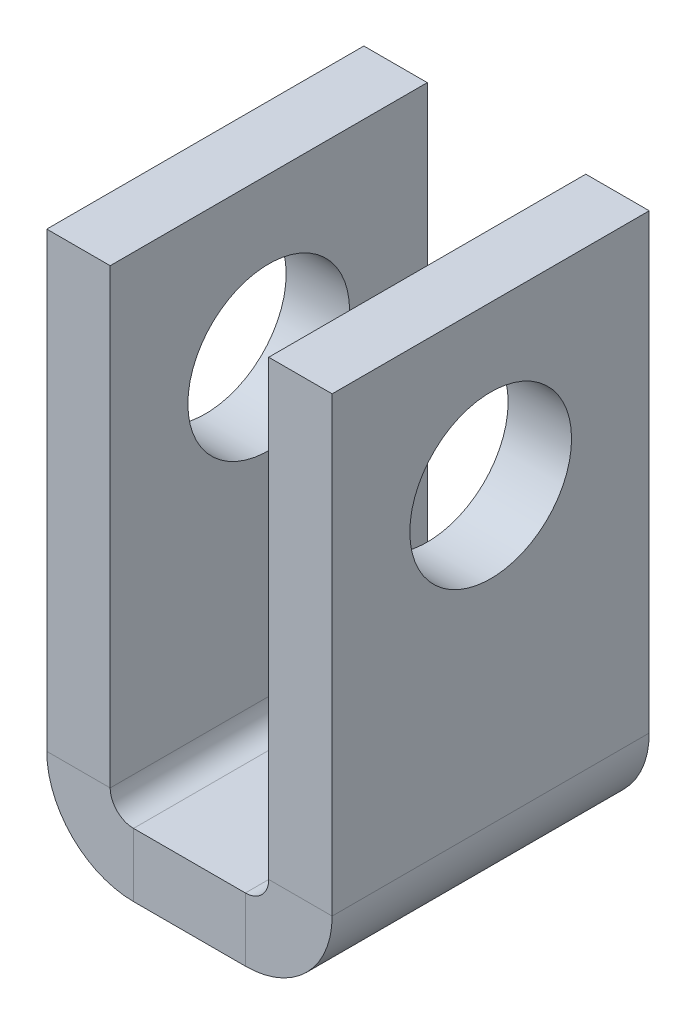
ISO-10303-21;
HEADER;
FILE_DESCRIPTION(('STEP AP214'),'2;1');
FILE_NAME('part.step','',(''),(''),'','','');
FILE_SCHEMA(('AUTOMOTIVE_DESIGN { 1 0 10303 214 1 1 1 1 }'));
ENDSEC;
DATA;
#1=APPLICATION_CONTEXT('core data for automotive mechanical design processes');
#2=APPLICATION_PROTOCOL_DEFINITION('international standard','automotive_design',2000,#1);
#3=PRODUCT_CONTEXT('',#1,'mechanical');
#4=PRODUCT('Part','Part','',(#3));
#5=PRODUCT_RELATED_PRODUCT_CATEGORY('part','',(#4));
#6=PRODUCT_DEFINITION_FORMATION('','',#4);
#7=PRODUCT_DEFINITION_CONTEXT('part definition',#1,'design');
#8=PRODUCT_DEFINITION('design','',#6,#7);
#9=PRODUCT_DEFINITION_SHAPE('','',#8);
#10=(LENGTH_UNIT() NAMED_UNIT(*) SI_UNIT(.MILLI.,.METRE.));
#11=(NAMED_UNIT(*) PLANE_ANGLE_UNIT() SI_UNIT($,.RADIAN.));
#12=(NAMED_UNIT(*) SI_UNIT($,.STERADIAN.) SOLID_ANGLE_UNIT());
#13=UNCERTAINTY_MEASURE_WITH_UNIT(LENGTH_MEASURE(1.E-05),#10,'distance_accuracy_value','');
#14=(GEOMETRIC_REPRESENTATION_CONTEXT(3) GLOBAL_UNCERTAINTY_ASSIGNED_CONTEXT((#13)) GLOBAL_UNIT_ASSIGNED_CONTEXT((#10,
#11,#12)) REPRESENTATION_CONTEXT('',''));
#15=CARTESIAN_POINT('',(0.,0.,0.));
#16=DIRECTION('',(0.,0.,1.));
#17=DIRECTION('',(1.,0.,0.));
#18=AXIS2_PLACEMENT_3D('',#15,#16,#17);
#19=CARTESIAN_POINT('',(0.7366,0.,10.));
#20=DIRECTION('',(0.,0.,1.));
#21=DIRECTION('',(1.,0.,0.));
#22=AXIS2_PLACEMENT_3D('',#19,#20,#21);
#23=PLANE('',#22);
#24=DIRECTION('',(0.,-1.,0.));
#25=VECTOR('',#24,1.);
#26=CARTESIAN_POINT('',(0.7366,0.,10.));
#27=LINE('',#26,#25);
#28=CARTESIAN_POINT('',(0.7366,0.,10.));
#29=VERTEX_POINT('',#28);
#30=CARTESIAN_POINT('',(0.7366,-2.,10.));
#31=VERTEX_POINT('',#30);
#32=EDGE_CURVE('E11',#29,#31,#27,.T.);
#33=ORIENTED_EDGE('',*,*,#32,.F.);
#34=CARTESIAN_POINT('',(0.7366,0.7366,10.));
#35=DIRECTION('',(0.,0.,-1.));
#36=DIRECTION('',(-1.,0.,0.));
#37=AXIS2_PLACEMENT_3D('',#34,#35,#36);
#38=CIRCLE('',#37,0.7366);
#39=CARTESIAN_POINT('',(0.,0.7366,10.));
#40=VERTEX_POINT('',#39);
#41=EDGE_CURVE('E250',#40,#29,#38,.F.);
#42=ORIENTED_EDGE('',*,*,#41,.F.);
#43=DIRECTION('',(1.,0.,0.));
#44=VECTOR('',#43,1.);
#45=CARTESIAN_POINT('',(-2.,0.736600000000001,10.));
#46=LINE('',#45,#44);
#47=CARTESIAN_POINT('',(-2.,0.736600000000001,10.));
#48=VERTEX_POINT('',#47);
#49=EDGE_CURVE('E47',#48,#40,#46,.T.);
#50=ORIENTED_EDGE('',*,*,#49,.F.);
#51=CARTESIAN_POINT('',(0.7366,0.7366,10.));
#52=DIRECTION('',(0.,0.,1.));
#53=DIRECTION('',(1.,0.,0.));
#54=AXIS2_PLACEMENT_3D('',#51,#52,#53);
#55=CIRCLE('',#54,2.7366);
#56=EDGE_CURVE('E148',#48,#31,#55,.T.);
#57=ORIENTED_EDGE('',*,*,#56,.T.);
#58=EDGE_LOOP('',(#33,#42,#50,#57));
#59=FACE_BOUND('',#58,.T.);
#60=ADVANCED_FACE('F39',(#59),#23,.T.);
#61=CARTESIAN_POINT('',(-2.,0.736600000000001,10.));
#62=DIRECTION('',(0.,0.,1.));
#63=DIRECTION('',(1.,0.,0.));
#64=AXIS2_PLACEMENT_3D('',#61,#62,#63);
#65=PLANE('',#64);
#66=DIRECTION('',(1.,0.,0.));
#67=VECTOR('',#66,1.);
#68=CARTESIAN_POINT('',(0.,0.,10.));
#69=LINE('',#68,#67);
#70=CARTESIAN_POINT('',(4.2634,0.,10.));
#71=VERTEX_POINT('',#70);
#72=EDGE_CURVE('E142',#29,#71,#69,.T.);
#73=ORIENTED_EDGE('',*,*,#72,.F.);
#74=ORIENTED_EDGE('',*,*,#32,.T.);
#75=DIRECTION('',(1.,0.,0.));
#76=VECTOR('',#75,1.);
#77=CARTESIAN_POINT('',(0.,-2.,10.));
#78=LINE('',#77,#76);
#79=CARTESIAN_POINT('',(4.2634,-2.,10.));
#80=VERTEX_POINT('',#79);
#81=EDGE_CURVE('E139',#31,#80,#78,.T.);
#82=ORIENTED_EDGE('',*,*,#81,.T.);
#83=DIRECTION('',(0.,1.,0.));
#84=VECTOR('',#83,1.);
#85=CARTESIAN_POINT('',(4.2634,-2.,10.));
#86=LINE('',#85,#84);
#87=EDGE_CURVE('E231',#80,#71,#86,.T.);
#88=ORIENTED_EDGE('',*,*,#87,.T.);
#89=EDGE_LOOP('',(#73,#74,#82,#88));
#90=FACE_BOUND('',#89,.T.);
#91=ADVANCED_FACE('F137',(#90),#65,.T.);
#92=CARTESIAN_POINT('',(0.,0.7366,0.));
#93=DIRECTION('',(0.,0.,-1.));
#94=DIRECTION('',(-1.,0.,0.));
#95=AXIS2_PLACEMENT_3D('',#92,#93,#94);
#96=PLANE('',#95);
#97=DIRECTION('',(-1.,0.,0.));
#98=VECTOR('',#97,1.);
#99=CARTESIAN_POINT('',(0.,0.7366,0.));
#100=LINE('',#99,#98);
#101=CARTESIAN_POINT('',(0.,0.7366,0.));
#102=VERTEX_POINT('',#101);
#103=CARTESIAN_POINT('',(-2.,0.736600000000001,0.));
#104=VERTEX_POINT('',#103);
#105=EDGE_CURVE('E236',#102,#104,#100,.T.);
#106=ORIENTED_EDGE('',*,*,#105,.F.);
#107=CARTESIAN_POINT('',(0.7366,0.7366,0.));
#108=DIRECTION('',(0.,0.,-1.));
#109=DIRECTION('',(-1.,0.,0.));
#110=AXIS2_PLACEMENT_3D('',#107,#108,#109);
#111=CIRCLE('',#110,0.7366);
#112=CARTESIAN_POINT('',(0.7366,0.,0.));
#113=VERTEX_POINT('',#112);
#114=EDGE_CURVE('E188',#102,#113,#111,.F.);
#115=ORIENTED_EDGE('',*,*,#114,.T.);
#116=DIRECTION('',(0.,1.,0.));
#117=VECTOR('',#116,1.);
#118=CARTESIAN_POINT('',(0.7366,-2.,0.));
#119=LINE('',#118,#117);
#120=CARTESIAN_POINT('',(0.7366,-2.,0.));
#121=VERTEX_POINT('',#120);
#122=EDGE_CURVE('E234',#121,#113,#119,.T.);
#123=ORIENTED_EDGE('',*,*,#122,.F.);
#124=CARTESIAN_POINT('',(0.7366,0.7366,0.));
#125=DIRECTION('',(0.,0.,1.));
#126=DIRECTION('',(1.,0.,0.));
#127=AXIS2_PLACEMENT_3D('',#124,#125,#126);
#128=CIRCLE('',#127,2.7366);
#129=EDGE_CURVE('E160',#104,#121,#128,.T.);
#130=ORIENTED_EDGE('',*,*,#129,.F.);
#131=EDGE_LOOP('',(#106,#115,#123,#130));
#132=FACE_BOUND('',#131,.T.);
#133=ADVANCED_FACE('F300',(#132),#96,.T.);
#134=CARTESIAN_POINT('',(0.7366,-2.,0.));
#135=DIRECTION('',(0.,0.,-1.));
#136=DIRECTION('',(-1.,0.,0.));
#137=AXIS2_PLACEMENT_3D('',#134,#135,#136);
#138=PLANE('',#137);
#139=DIRECTION('',(0.,-1.,0.));
#140=VECTOR('',#139,1.);
#141=CARTESIAN_POINT('',(0.,15.,0.));
#142=LINE('',#141,#140);
#143=CARTESIAN_POINT('',(0.,15.,0.));
#144=VERTEX_POINT('',#143);
#145=EDGE_CURVE('E191',#144,#102,#142,.T.);
#146=ORIENTED_EDGE('',*,*,#145,.T.);
#147=ORIENTED_EDGE('',*,*,#105,.T.);
#148=DIRECTION('',(0.,1.,0.));
#149=VECTOR('',#148,1.);
#150=CARTESIAN_POINT('',(-2.,15.,0.));
#151=LINE('',#150,#149);
#152=CARTESIAN_POINT('',(-2.,15.,0.));
#153=VERTEX_POINT('',#152);
#154=EDGE_CURVE('E197',#153,#104,#151,.F.);
#155=ORIENTED_EDGE('',*,*,#154,.F.);
#156=DIRECTION('',(1.,0.,0.));
#157=VECTOR('',#156,1.);
#158=CARTESIAN_POINT('',(-2.,15.,0.));
#159=LINE('',#158,#157);
#160=EDGE_CURVE('E194',#153,#144,#159,.T.);
#161=ORIENTED_EDGE('',*,*,#160,.T.);
#162=EDGE_LOOP('',(#146,#147,#155,#161));
#163=FACE_BOUND('',#162,.T.);
#164=ADVANCED_FACE('F304',(#163),#138,.T.);
#165=CARTESIAN_POINT('',(5.,0.7366,10.));
#166=DIRECTION('',(0.,0.,1.));
#167=DIRECTION('',(1.,0.,0.));
#168=AXIS2_PLACEMENT_3D('',#165,#166,#167);
#169=PLANE('',#168);
#170=DIRECTION('',(1.,0.,0.));
#171=VECTOR('',#170,1.);
#172=CARTESIAN_POINT('',(5.,0.7366,10.));
#173=LINE('',#172,#171);
#174=CARTESIAN_POINT('',(5.,0.7366,10.));
#175=VERTEX_POINT('',#174);
#176=CARTESIAN_POINT('',(7.,0.7366,10.));
#177=VERTEX_POINT('',#176);
#178=EDGE_CURVE('E55',#175,#177,#173,.T.);
#179=ORIENTED_EDGE('',*,*,#178,.F.);
#180=CARTESIAN_POINT('',(4.2634,0.7366,10.));
#181=DIRECTION('',(0.,0.,-1.));
#182=DIRECTION('',(-1.,0.,0.));
#183=AXIS2_PLACEMENT_3D('',#180,#181,#182);
#184=CIRCLE('',#183,0.7366);
#185=EDGE_CURVE('E260',#71,#175,#184,.F.);
#186=ORIENTED_EDGE('',*,*,#185,.F.);
#187=ORIENTED_EDGE('',*,*,#87,.F.);
#188=CARTESIAN_POINT('',(4.2634,0.7366,10.));
#189=DIRECTION('',(0.,0.,1.));
#190=DIRECTION('',(1.,0.,0.));
#191=AXIS2_PLACEMENT_3D('',#188,#189,#190);
#192=CIRCLE('',#191,2.7366);
#193=EDGE_CURVE('E168',#80,#177,#192,.T.);
#194=ORIENTED_EDGE('',*,*,#193,.T.);
#195=EDGE_LOOP('',(#179,#186,#187,#194));
#196=FACE_BOUND('',#195,.T.);
#197=ADVANCED_FACE('F310',(#196),#169,.T.);
#198=CARTESIAN_POINT('',(4.2634,-2.,10.));
#199=DIRECTION('',(0.,0.,1.));
#200=DIRECTION('',(1.,0.,0.));
#201=AXIS2_PLACEMENT_3D('',#198,#199,#200);
#202=PLANE('',#201);
#203=DIRECTION('',(0.,1.,0.));
#204=VECTOR('',#203,1.);
#205=CARTESIAN_POINT('',(5.,0.,10.));
#206=LINE('',#205,#204);
#207=CARTESIAN_POINT('',(5.,15.,10.));
#208=VERTEX_POINT('',#207);
#209=EDGE_CURVE('E263',#175,#208,#206,.T.);
#210=ORIENTED_EDGE('',*,*,#209,.F.);
#211=ORIENTED_EDGE('',*,*,#178,.T.);
#212=DIRECTION('',(0.,1.,0.));
#213=VECTOR('',#212,1.);
#214=CARTESIAN_POINT('',(7.,0.,10.));
#215=LINE('',#214,#213);
#216=CARTESIAN_POINT('',(7.,15.,10.));
#217=VERTEX_POINT('',#216);
#218=EDGE_CURVE('E109',#177,#217,#215,.T.);
#219=ORIENTED_EDGE('',*,*,#218,.T.);
#220=DIRECTION('',(1.,0.,0.));
#221=VECTOR('',#220,1.);
#222=CARTESIAN_POINT('',(5.,15.,10.));
#223=LINE('',#222,#221);
#224=EDGE_CURVE('E266',#208,#217,#223,.T.);
#225=ORIENTED_EDGE('',*,*,#224,.F.);
#226=EDGE_LOOP('',(#210,#211,#219,#225));
#227=FACE_BOUND('',#226,.T.);
#228=ADVANCED_FACE('F314',(#227),#202,.T.);
#229=CARTESIAN_POINT('',(4.2634,0.,0.));
#230=DIRECTION('',(0.,0.,-1.));
#231=DIRECTION('',(-1.,0.,0.));
#232=AXIS2_PLACEMENT_3D('',#229,#230,#231);
#233=PLANE('',#232);
#234=DIRECTION('',(0.,-1.,0.));
#235=VECTOR('',#234,1.);
#236=CARTESIAN_POINT('',(4.2634,0.,0.));
#237=LINE('',#236,#235);
#238=CARTESIAN_POINT('',(4.2634,0.,0.));
#239=VERTEX_POINT('',#238);
#240=CARTESIAN_POINT('',(4.2634,-2.,0.));
#241=VERTEX_POINT('',#240);
#242=EDGE_CURVE('E96',#239,#241,#237,.T.);
#243=ORIENTED_EDGE('',*,*,#242,.F.);
#244=CARTESIAN_POINT('',(4.2634,0.7366,0.));
#245=DIRECTION('',(0.,0.,-1.));
#246=DIRECTION('',(-1.,0.,0.));
#247=AXIS2_PLACEMENT_3D('',#244,#245,#246);
#248=CIRCLE('',#247,0.7366);
#249=CARTESIAN_POINT('',(5.,0.7366,0.));
#250=VERTEX_POINT('',#249);
#251=EDGE_CURVE('E184',#239,#250,#248,.F.);
#252=ORIENTED_EDGE('',*,*,#251,.T.);
#253=DIRECTION('',(-1.,0.,0.));
#254=VECTOR('',#253,1.);
#255=CARTESIAN_POINT('',(7.,0.7366,0.));
#256=LINE('',#255,#254);
#257=CARTESIAN_POINT('',(7.,0.7366,0.));
#258=VERTEX_POINT('',#257);
#259=EDGE_CURVE('E103',#258,#250,#256,.T.);
#260=ORIENTED_EDGE('',*,*,#259,.F.);
#261=CARTESIAN_POINT('',(4.2634,0.7366,0.));
#262=DIRECTION('',(0.,0.,1.));
#263=DIRECTION('',(1.,0.,0.));
#264=AXIS2_PLACEMENT_3D('',#261,#262,#263);
#265=CIRCLE('',#264,2.7366);
#266=EDGE_CURVE('E203',#241,#258,#265,.T.);
#267=ORIENTED_EDGE('',*,*,#266,.F.);
#268=EDGE_LOOP('',(#243,#252,#260,#267));
#269=FACE_BOUND('',#268,.T.);
#270=ADVANCED_FACE('F318',(#269),#233,.T.);
#271=CARTESIAN_POINT('',(7.,0.7366,0.));
#272=DIRECTION('',(0.,0.,-1.));
#273=DIRECTION('',(-1.,0.,0.));
#274=AXIS2_PLACEMENT_3D('',#271,#272,#273);
#275=PLANE('',#274);
#276=DIRECTION('',(1.,0.,0.));
#277=VECTOR('',#276,1.);
#278=CARTESIAN_POINT('',(0.,0.,0.));
#279=LINE('',#278,#277);
#280=EDGE_CURVE('E186',#113,#239,#279,.T.);
#281=ORIENTED_EDGE('',*,*,#280,.T.);
#282=ORIENTED_EDGE('',*,*,#242,.T.);
#283=DIRECTION('',(1.,0.,0.));
#284=VECTOR('',#283,1.);
#285=CARTESIAN_POINT('',(0.,-2.,0.));
#286=LINE('',#285,#284);
#287=EDGE_CURVE('E201',#121,#241,#286,.T.);
#288=ORIENTED_EDGE('',*,*,#287,.F.);
#289=ORIENTED_EDGE('',*,*,#122,.T.);
#290=EDGE_LOOP('',(#281,#282,#288,#289));
#291=FACE_BOUND('',#290,.T.);
#292=ADVANCED_FACE('F321',(#291),#275,.T.);
#293=CARTESIAN_POINT('',(7.,0.,10.));
#294=DIRECTION('',(-1.,0.,0.));
#295=DIRECTION('',(0.,0.,1.));
#296=AXIS2_PLACEMENT_3D('',#293,#294,#295);
#297=PLANE('',#296);
#298=CARTESIAN_POINT('',(7.,10.,5.));
#299=DIRECTION('',(-1.,0.,0.));
#300=DIRECTION('',(0.,0.,1.));
#301=AXIS2_PLACEMENT_3D('',#298,#299,#300);
#302=CIRCLE('',#301,2.55);
#303=CARTESIAN_POINT('',(7.,10.,7.55));
#304=VERTEX_POINT('',#303);
#305=EDGE_CURVE('E275',#304,#304,#302,.T.);
#306=ORIENTED_EDGE('',*,*,#305,.T.);
#307=EDGE_LOOP('',(#306));
#308=FACE_BOUND('',#307,.T.);
#309=DIRECTION('',(0.,1.,0.));
#310=VECTOR('',#309,1.);
#311=CARTESIAN_POINT('',(7.,0.,0.));
#312=LINE('',#311,#310);
#313=CARTESIAN_POINT('',(7.,15.,0.));
#314=VERTEX_POINT('',#313);
#315=EDGE_CURVE('E174',#258,#314,#312,.T.);
#316=ORIENTED_EDGE('',*,*,#315,.T.);
#317=DIRECTION('',(0.,0.,-1.));
#318=VECTOR('',#317,1.);
#319=CARTESIAN_POINT('',(7.,15.,10.));
#320=LINE('',#319,#318);
#321=EDGE_CURVE('E227',#217,#314,#320,.T.);
#322=ORIENTED_EDGE('',*,*,#321,.F.);
#323=ORIENTED_EDGE('',*,*,#218,.F.);
#324=DIRECTION('',(0.,0.,-1.));
#325=VECTOR('',#324,1.);
#326=CARTESIAN_POINT('',(7.,0.7366,10.));
#327=LINE('',#326,#325);
#328=EDGE_CURVE('E170',#177,#258,#327,.T.);
#329=ORIENTED_EDGE('',*,*,#328,.T.);
#330=EDGE_LOOP('',(#316,#322,#323,#329));
#331=FACE_BOUND('',#330,.T.);
#332=ADVANCED_FACE('F282',(#308,#331),#297,.F.);
#333=CARTESIAN_POINT('',(5.,15.,10.));
#334=DIRECTION('',(0.,1.,0.));
#335=DIRECTION('',(0.,0.,1.));
#336=AXIS2_PLACEMENT_3D('',#333,#334,#335);
#337=PLANE('',#336);
#338=DIRECTION('',(1.,0.,0.));
#339=VECTOR('',#338,1.);
#340=CARTESIAN_POINT('',(5.,15.,0.));
#341=LINE('',#340,#339);
#342=CARTESIAN_POINT('',(5.,15.,0.));
#343=VERTEX_POINT('',#342);
#344=EDGE_CURVE('E177',#343,#314,#341,.T.);
#345=ORIENTED_EDGE('',*,*,#344,.F.);
#346=DIRECTION('',(0.,0.,-1.));
#347=VECTOR('',#346,1.);
#348=CARTESIAN_POINT('',(5.,15.,10.));
#349=LINE('',#348,#347);
#350=EDGE_CURVE('E225',#208,#343,#349,.T.);
#351=ORIENTED_EDGE('',*,*,#350,.F.);
#352=ORIENTED_EDGE('',*,*,#224,.T.);
#353=ORIENTED_EDGE('',*,*,#321,.T.);
#354=EDGE_LOOP('',(#345,#351,#352,#353));
#355=FACE_BOUND('',#354,.T.);
#356=ADVANCED_FACE('F326',(#355),#337,.T.);
#357=CARTESIAN_POINT('',(5.,0.,10.));
#358=DIRECTION('',(-1.,0.,0.));
#359=DIRECTION('',(0.,0.,1.));
#360=AXIS2_PLACEMENT_3D('',#357,#358,#359);
#361=PLANE('',#360);
#362=CARTESIAN_POINT('',(5.,10.,5.));
#363=DIRECTION('',(-1.,0.,0.));
#364=DIRECTION('',(0.,0.,1.));
#365=AXIS2_PLACEMENT_3D('',#362,#363,#364);
#366=CIRCLE('',#365,2.55);
#367=CARTESIAN_POINT('',(5.,10.,7.55));
#368=VERTEX_POINT('',#367);
#369=EDGE_CURVE('E178',#368,#368,#366,.T.);
#370=ORIENTED_EDGE('',*,*,#369,.F.);
#371=EDGE_LOOP('',(#370));
#372=FACE_BOUND('',#371,.T.);
#373=DIRECTION('',(0.,1.,0.));
#374=VECTOR('',#373,1.);
#375=CARTESIAN_POINT('',(5.,0.,0.));
#376=LINE('',#375,#374);
#377=EDGE_CURVE('E181',#250,#343,#376,.T.);
#378=ORIENTED_EDGE('',*,*,#377,.F.);
#379=DIRECTION('',(0.,0.,-1.));
#380=VECTOR('',#379,1.);
#381=CARTESIAN_POINT('',(5.,0.7366,10.));
#382=LINE('',#381,#380);
#383=EDGE_CURVE('E222',#175,#250,#382,.T.);
#384=ORIENTED_EDGE('',*,*,#383,.F.);
#385=ORIENTED_EDGE('',*,*,#209,.T.);
#386=ORIENTED_EDGE('',*,*,#350,.T.);
#387=EDGE_LOOP('',(#378,#384,#385,#386));
#388=FACE_BOUND('',#387,.T.);
#389=ADVANCED_FACE('F329',(#372,#388),#361,.T.);
#390=CARTESIAN_POINT('',(4.2634,0.7366,10.));
#391=DIRECTION('',(0.,0.,-1.));
#392=DIRECTION('',(-1.,0.,0.));
#393=AXIS2_PLACEMENT_3D('',#390,#391,#392);
#394=CYLINDRICAL_SURFACE('',#393,0.7366);
#395=ORIENTED_EDGE('',*,*,#251,.F.);
#396=DIRECTION('',(0.,0.,-1.));
#397=VECTOR('',#396,1.);
#398=CARTESIAN_POINT('',(4.2634,0.,10.));
#399=LINE('',#398,#397);
#400=EDGE_CURVE('E219',#71,#239,#399,.T.);
#401=ORIENTED_EDGE('',*,*,#400,.F.);
#402=ORIENTED_EDGE('',*,*,#185,.T.);
#403=ORIENTED_EDGE('',*,*,#383,.T.);
#404=EDGE_LOOP('',(#395,#401,#402,#403));
#405=FACE_BOUND('',#404,.T.);
#406=ADVANCED_FACE('F333',(#405),#394,.F.);
#407=CARTESIAN_POINT('',(0.,0.,10.));
#408=DIRECTION('',(0.,1.,0.));
#409=DIRECTION('',(0.,0.,1.));
#410=AXIS2_PLACEMENT_3D('',#407,#408,#409);
#411=PLANE('',#410);
#412=ORIENTED_EDGE('',*,*,#280,.F.);
#413=DIRECTION('',(0.,0.,-1.));
#414=VECTOR('',#413,1.);
#415=CARTESIAN_POINT('',(0.7366,0.,10.));
#416=LINE('',#415,#414);
#417=EDGE_CURVE('E216',#29,#113,#416,.T.);
#418=ORIENTED_EDGE('',*,*,#417,.F.);
#419=ORIENTED_EDGE('',*,*,#72,.T.);
#420=ORIENTED_EDGE('',*,*,#400,.T.);
#421=EDGE_LOOP('',(#412,#418,#419,#420));
#422=FACE_BOUND('',#421,.T.);
#423=ADVANCED_FACE('F337',(#422),#411,.T.);
#424=CARTESIAN_POINT('',(0.7366,0.7366,10.));
#425=DIRECTION('',(0.,0.,-1.));
#426=DIRECTION('',(-1.,0.,0.));
#427=AXIS2_PLACEMENT_3D('',#424,#425,#426);
#428=CYLINDRICAL_SURFACE('',#427,0.7366);
#429=ORIENTED_EDGE('',*,*,#114,.F.);
#430=DIRECTION('',(0.,0.,-1.));
#431=VECTOR('',#430,1.);
#432=CARTESIAN_POINT('',(0.,0.7366,10.));
#433=LINE('',#432,#431);
#434=EDGE_CURVE('E213',#40,#102,#433,.T.);
#435=ORIENTED_EDGE('',*,*,#434,.F.);
#436=ORIENTED_EDGE('',*,*,#41,.T.);
#437=ORIENTED_EDGE('',*,*,#417,.T.);
#438=EDGE_LOOP('',(#429,#435,#436,#437));
#439=FACE_BOUND('',#438,.T.);
#440=ADVANCED_FACE('F249',(#439),#428,.F.);
#441=CARTESIAN_POINT('',(0.,15.,10.));
#442=DIRECTION('',(1.,0.,0.));
#443=DIRECTION('',(0.,0.,-1.));
#444=AXIS2_PLACEMENT_3D('',#441,#442,#443);
#445=PLANE('',#444);
#446=CARTESIAN_POINT('',(0.,10.,5.));
#447=DIRECTION('',(1.,0.,0.));
#448=DIRECTION('',(0.,0.,-1.));
#449=AXIS2_PLACEMENT_3D('',#446,#447,#448);
#450=CIRCLE('',#449,2.55);
#451=CARTESIAN_POINT('',(0.,10.,2.45));
#452=VERTEX_POINT('',#451);
#453=EDGE_CURVE('E272',#452,#452,#450,.T.);
#454=ORIENTED_EDGE('',*,*,#453,.F.);
#455=EDGE_LOOP('',(#454));
#456=FACE_BOUND('',#455,.T.);
#457=ORIENTED_EDGE('',*,*,#145,.F.);
#458=DIRECTION('',(0.,0.,-1.));
#459=VECTOR('',#458,1.);
#460=CARTESIAN_POINT('',(0.,15.,10.));
#461=LINE('',#460,#459);
#462=CARTESIAN_POINT('',(0.,15.,10.));
#463=VERTEX_POINT('',#462);
#464=EDGE_CURVE('E211',#463,#144,#461,.T.);
#465=ORIENTED_EDGE('',*,*,#464,.F.);
#466=DIRECTION('',(0.,-1.,0.));
#467=VECTOR('',#466,1.);
#468=CARTESIAN_POINT('',(0.,15.,10.));
#469=LINE('',#468,#467);
#470=EDGE_CURVE('E243',#463,#40,#469,.T.);
#471=ORIENTED_EDGE('',*,*,#470,.T.);
#472=ORIENTED_EDGE('',*,*,#434,.T.);
#473=EDGE_LOOP('',(#457,#465,#471,#472));
#474=FACE_BOUND('',#473,.T.);
#475=ADVANCED_FACE('F254',(#456,#474),#445,.T.);
#476=CARTESIAN_POINT('',(-2.,15.,10.));
#477=DIRECTION('',(0.,1.,0.));
#478=DIRECTION('',(0.,0.,1.));
#479=AXIS2_PLACEMENT_3D('',#476,#477,#478);
#480=PLANE('',#479);
#481=ORIENTED_EDGE('',*,*,#160,.F.);
#482=DIRECTION('',(0.,0.,-1.));
#483=VECTOR('',#482,1.);
#484=CARTESIAN_POINT('',(-2.,15.,10.));
#485=LINE('',#484,#483);
#486=CARTESIAN_POINT('',(-2.,15.,10.));
#487=VERTEX_POINT('',#486);
#488=EDGE_CURVE('E209',#487,#153,#485,.T.);
#489=ORIENTED_EDGE('',*,*,#488,.F.);
#490=DIRECTION('',(1.,0.,0.));
#491=VECTOR('',#490,1.);
#492=CARTESIAN_POINT('',(-2.,15.,10.));
#493=LINE('',#492,#491);
#494=EDGE_CURVE('E255',#487,#463,#493,.T.);
#495=ORIENTED_EDGE('',*,*,#494,.T.);
#496=ORIENTED_EDGE('',*,*,#464,.T.);
#497=EDGE_LOOP('',(#481,#489,#495,#496));
#498=FACE_BOUND('',#497,.T.);
#499=ADVANCED_FACE('F346',(#498),#480,.T.);
#500=CARTESIAN_POINT('',(-2.,15.,10.));
#501=DIRECTION('',(1.,0.,0.));
#502=DIRECTION('',(0.,0.,-1.));
#503=AXIS2_PLACEMENT_3D('',#500,#501,#502);
#504=PLANE('',#503);
#505=CARTESIAN_POINT('',(-2.,10.,5.));
#506=DIRECTION('',(-1.,0.,0.));
#507=DIRECTION('',(0.,0.,1.));
#508=AXIS2_PLACEMENT_3D('',#505,#506,#507);
#509=CIRCLE('',#508,2.55);
#510=CARTESIAN_POINT('',(-2.,10.,7.55));
#511=VERTEX_POINT('',#510);
#512=EDGE_CURVE('E276',#511,#511,#509,.T.);
#513=ORIENTED_EDGE('',*,*,#512,.F.);
#514=EDGE_LOOP('',(#513));
#515=FACE_BOUND('',#514,.T.);
#516=ORIENTED_EDGE('',*,*,#154,.T.);
#517=DIRECTION('',(0.,0.,-1.));
#518=VECTOR('',#517,1.);
#519=CARTESIAN_POINT('',(-2.,0.736600000000001,10.));
#520=LINE('',#519,#518);
#521=EDGE_CURVE('E162',#48,#104,#520,.T.);
#522=ORIENTED_EDGE('',*,*,#521,.F.);
#523=DIRECTION('',(0.,1.,0.));
#524=VECTOR('',#523,1.);
#525=CARTESIAN_POINT('',(-2.,15.,10.));
#526=LINE('',#525,#524);
#527=EDGE_CURVE('E153',#487,#48,#526,.F.);
#528=ORIENTED_EDGE('',*,*,#527,.F.);
#529=ORIENTED_EDGE('',*,*,#488,.T.);
#530=EDGE_LOOP('',(#516,#522,#528,#529));
#531=FACE_BOUND('',#530,.T.);
#532=ADVANCED_FACE('F350',(#515,#531),#504,.F.);
#533=CARTESIAN_POINT('',(0.7366,0.7366,10.));
#534=DIRECTION('',(0.,0.,-1.));
#535=DIRECTION('',(-1.,0.,0.));
#536=AXIS2_PLACEMENT_3D('',#533,#534,#535);
#537=CYLINDRICAL_SURFACE('',#536,2.7366);
#538=ORIENTED_EDGE('',*,*,#129,.T.);
#539=DIRECTION('',(0.,0.,-1.));
#540=VECTOR('',#539,1.);
#541=CARTESIAN_POINT('',(0.7366,-2.,10.));
#542=LINE('',#541,#540);
#543=EDGE_CURVE('E157',#31,#121,#542,.T.);
#544=ORIENTED_EDGE('',*,*,#543,.F.);
#545=ORIENTED_EDGE('',*,*,#56,.F.);
#546=ORIENTED_EDGE('',*,*,#521,.T.);
#547=EDGE_LOOP('',(#538,#544,#545,#546));
#548=FACE_BOUND('',#547,.T.);
#549=ADVANCED_FACE('F158',(#548),#537,.T.);
#550=CARTESIAN_POINT('',(0.,-2.,10.));
#551=DIRECTION('',(0.,1.,0.));
#552=DIRECTION('',(0.,0.,1.));
#553=AXIS2_PLACEMENT_3D('',#550,#551,#552);
#554=PLANE('',#553);
#555=ORIENTED_EDGE('',*,*,#287,.T.);
#556=DIRECTION('',(0.,0.,-1.));
#557=VECTOR('',#556,1.);
#558=CARTESIAN_POINT('',(4.2634,-2.,10.));
#559=LINE('',#558,#557);
#560=EDGE_CURVE('E163',#80,#241,#559,.T.);
#561=ORIENTED_EDGE('',*,*,#560,.F.);
#562=ORIENTED_EDGE('',*,*,#81,.F.);
#563=ORIENTED_EDGE('',*,*,#543,.T.);
#564=EDGE_LOOP('',(#555,#561,#562,#563));
#565=FACE_BOUND('',#564,.T.);
#566=ADVANCED_FACE('F165',(#565),#554,.F.);
#567=CARTESIAN_POINT('',(4.2634,0.7366,10.));
#568=DIRECTION('',(0.,0.,-1.));
#569=DIRECTION('',(-1.,0.,0.));
#570=AXIS2_PLACEMENT_3D('',#567,#568,#569);
#571=CYLINDRICAL_SURFACE('',#570,2.7366);
#572=ORIENTED_EDGE('',*,*,#266,.T.);
#573=ORIENTED_EDGE('',*,*,#328,.F.);
#574=ORIENTED_EDGE('',*,*,#193,.F.);
#575=ORIENTED_EDGE('',*,*,#560,.T.);
#576=EDGE_LOOP('',(#572,#573,#574,#575));
#577=FACE_BOUND('',#576,.T.);
#578=ADVANCED_FACE('F359',(#577),#571,.T.);
#579=CARTESIAN_POINT('',(4.2634,0.7366,10.));
#580=DIRECTION('',(0.,0.,-1.));
#581=DIRECTION('',(-1.,0.,0.));
#582=AXIS2_PLACEMENT_3D('',#579,#580,#581);
#583=PLANE('',#582);
#584=ORIENTED_EDGE('',*,*,#527,.T.);
#585=ORIENTED_EDGE('',*,*,#49,.T.);
#586=ORIENTED_EDGE('',*,*,#470,.F.);
#587=ORIENTED_EDGE('',*,*,#494,.F.);
#588=EDGE_LOOP('',(#584,#585,#586,#587));
#589=FACE_BOUND('',#588,.T.);
#590=ADVANCED_FACE('F240',(#589),#583,.F.);
#591=CARTESIAN_POINT('',(4.2634,0.7366,0.));
#592=DIRECTION('',(0.,0.,-1.));
#593=DIRECTION('',(-1.,0.,0.));
#594=AXIS2_PLACEMENT_3D('',#591,#592,#593);
#595=PLANE('',#594);
#596=ORIENTED_EDGE('',*,*,#315,.F.);
#597=ORIENTED_EDGE('',*,*,#259,.T.);
#598=ORIENTED_EDGE('',*,*,#377,.T.);
#599=ORIENTED_EDGE('',*,*,#344,.T.);
#600=EDGE_LOOP('',(#596,#597,#598,#599));
#601=FACE_BOUND('',#600,.T.);
#602=ADVANCED_FACE('F293',(#601),#595,.T.);
#603=CARTESIAN_POINT('',(7.,10.,5.));
#604=DIRECTION('',(-1.,0.,0.));
#605=DIRECTION('',(0.,0.,1.));
#606=AXIS2_PLACEMENT_3D('',#603,#604,#605);
#607=CYLINDRICAL_SURFACE('',#606,2.55);
#608=ORIENTED_EDGE('',*,*,#453,.T.);
#609=EDGE_LOOP('',(#608));
#610=FACE_BOUND('',#609,.T.);
#611=ORIENTED_EDGE('',*,*,#512,.T.);
#612=EDGE_LOOP('',(#611));
#613=FACE_BOUND('',#612,.T.);
#614=ADVANCED_FACE('F287',(#610,#613),#607,.F.);
#615=ORIENTED_EDGE('',*,*,#369,.T.);
#616=EDGE_LOOP('',(#615));
#617=FACE_BOUND('',#616,.T.);
#618=ORIENTED_EDGE('',*,*,#305,.F.);
#619=EDGE_LOOP('',(#618));
#620=FACE_BOUND('',#619,.T.);
#621=ADVANCED_FACE('F285',(#617,#620),#607,.F.);
#622=CLOSED_SHELL('',(#60,#91,#133,#164,#197,#228,#270,#292,#332,#356,#389,#406,#423,#440,#475,
#499,#532,#549,#566,#578,#590,#602,#614,#621));
#623=MANIFOLD_SOLID_BREP('B2',#622);
#624=ADVANCED_BREP_SHAPE_REPRESENTATION('',(#18,#623),#14);
#625=SHAPE_DEFINITION_REPRESENTATION(#9,#624);
ENDSEC;
END-ISO-10303-21;
